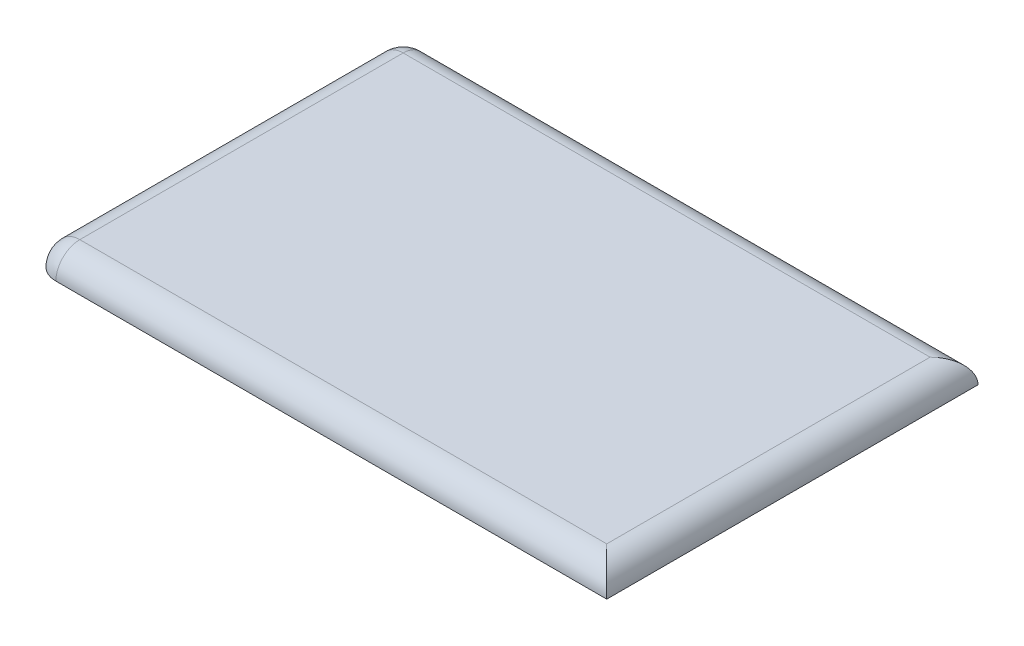
ISO-10303-21;
HEADER;
FILE_DESCRIPTION(('STEP AP214'),'2;1');
FILE_NAME('part.step','',(''),(''),'','','');
FILE_SCHEMA(('AUTOMOTIVE_DESIGN { 1 0 10303 214 1 1 1 1 }'));
ENDSEC;
DATA;
#1=APPLICATION_CONTEXT('core data for automotive mechanical design processes');
#2=APPLICATION_PROTOCOL_DEFINITION('international standard','automotive_design',2000,#1);
#3=PRODUCT_CONTEXT('',#1,'mechanical');
#4=PRODUCT('Part','Part','',(#3));
#5=PRODUCT_RELATED_PRODUCT_CATEGORY('part','',(#4));
#6=PRODUCT_DEFINITION_FORMATION('','',#4);
#7=PRODUCT_DEFINITION_CONTEXT('part definition',#1,'design');
#8=PRODUCT_DEFINITION('design','',#6,#7);
#9=PRODUCT_DEFINITION_SHAPE('','',#8);
#10=(LENGTH_UNIT() NAMED_UNIT(*) SI_UNIT(.MILLI.,.METRE.));
#11=(NAMED_UNIT(*) PLANE_ANGLE_UNIT() SI_UNIT($,.RADIAN.));
#12=(NAMED_UNIT(*) SI_UNIT($,.STERADIAN.) SOLID_ANGLE_UNIT());
#13=UNCERTAINTY_MEASURE_WITH_UNIT(LENGTH_MEASURE(1.E-05),#10,'distance_accuracy_value','');
#14=(GEOMETRIC_REPRESENTATION_CONTEXT(3) GLOBAL_UNCERTAINTY_ASSIGNED_CONTEXT((#13)) GLOBAL_UNIT_ASSIGNED_CONTEXT((#10,
#11,#12)) REPRESENTATION_CONTEXT('',''));
#15=CARTESIAN_POINT('',(0.,0.,0.));
#16=DIRECTION('',(0.,0.,1.));
#17=DIRECTION('',(1.,0.,0.));
#18=AXIS2_PLACEMENT_3D('',#15,#16,#17);
#19=CARTESIAN_POINT('',(0.,5.,0.));
#20=DIRECTION('',(0.,-1.,0.));
#21=DIRECTION('',(0.,0.,-1.));
#22=AXIS2_PLACEMENT_3D('',#19,#20,#21);
#23=PLANE('',#22);
#24=DIRECTION('',(1.,0.,0.));
#25=VECTOR('',#24,1.);
#26=CARTESIAN_POINT('',(0.,5.,-72.5));
#27=LINE('',#26,#25);
#28=CARTESIAN_POINT('',(115.,5.,-72.5));
#29=VERTEX_POINT('',#28);
#30=CARTESIAN_POINT('',(5.,5.,-72.5));
#31=VERTEX_POINT('',#30);
#32=EDGE_CURVE('E42',#29,#31,#27,.F.);
#33=ORIENTED_EDGE('',*,*,#32,.T.);
#34=DIRECTION('',(0.,0.,-1.));
#35=VECTOR('',#34,1.);
#36=CARTESIAN_POINT('',(5.,5.,0.));
#37=LINE('',#36,#35);
#38=CARTESIAN_POINT('',(5.,5.,-5.));
#39=VERTEX_POINT('',#38);
#40=EDGE_CURVE('E11',#31,#39,#37,.F.);
#41=ORIENTED_EDGE('',*,*,#40,.T.);
#42=DIRECTION('',(-1.,0.,0.));
#43=VECTOR('',#42,1.);
#44=CARTESIAN_POINT('',(120.,5.,-5.));
#45=LINE('',#44,#43);
#46=CARTESIAN_POINT('',(115.,5.,-5.));
#47=VERTEX_POINT('',#46);
#48=EDGE_CURVE('E114',#39,#47,#45,.F.);
#49=ORIENTED_EDGE('',*,*,#48,.T.);
#50=DIRECTION('',(0.,0.,1.));
#51=VECTOR('',#50,1.);
#52=CARTESIAN_POINT('',(115.,5.,-77.5));
#53=LINE('',#52,#51);
#54=EDGE_CURVE('E53',#47,#29,#53,.F.);
#55=ORIENTED_EDGE('',*,*,#54,.T.);
#56=EDGE_LOOP('',(#33,#41,#49,#55));
#57=FACE_BOUND('',#56,.T.);
#58=ADVANCED_FACE('F33',(#57),#23,.F.);
#59=CARTESIAN_POINT('',(0.,0.,0.));
#60=DIRECTION('',(0.,-1.,0.));
#61=DIRECTION('',(0.,0.,-1.));
#62=AXIS2_PLACEMENT_3D('',#59,#60,#61);
#63=PLANE('',#62);
#64=DIRECTION('',(0.,0.,-1.));
#65=VECTOR('',#64,1.);
#66=CARTESIAN_POINT('',(0.,0.,0.));
#67=LINE('',#66,#65);
#68=CARTESIAN_POINT('',(0.,0.,-5.));
#69=VERTEX_POINT('',#68);
#70=CARTESIAN_POINT('',(0.,0.,-72.5));
#71=VERTEX_POINT('',#70);
#72=EDGE_CURVE('E97',#69,#71,#67,.T.);
#73=ORIENTED_EDGE('',*,*,#72,.T.);
#74=CARTESIAN_POINT('',(5.,0.,-72.5));
#75=DIRECTION('',(0.,-1.,0.));
#76=DIRECTION('',(0.,0.,-1.));
#77=AXIS2_PLACEMENT_3D('',#74,#75,#76);
#78=CIRCLE('',#77,5.);
#79=CARTESIAN_POINT('',(5.,0.,-77.5));
#80=VERTEX_POINT('',#79);
#81=EDGE_CURVE('E116',#71,#80,#78,.T.);
#82=ORIENTED_EDGE('',*,*,#81,.T.);
#83=DIRECTION('',(1.,0.,0.));
#84=VECTOR('',#83,1.);
#85=CARTESIAN_POINT('',(0.,0.,-77.5));
#86=LINE('',#85,#84);
#87=CARTESIAN_POINT('',(120.,0.,-77.5));
#88=VERTEX_POINT('',#87);
#89=EDGE_CURVE('E86',#80,#88,#86,.T.);
#90=ORIENTED_EDGE('',*,*,#89,.T.);
#91=DIRECTION('',(0.,0.,1.));
#92=VECTOR('',#91,1.);
#93=CARTESIAN_POINT('',(120.,0.,-77.5));
#94=LINE('',#93,#92);
#95=CARTESIAN_POINT('',(120.,0.,0.));
#96=VERTEX_POINT('',#95);
#97=EDGE_CURVE('E79',#88,#96,#94,.T.);
#98=ORIENTED_EDGE('',*,*,#97,.T.);
#99=DIRECTION('',(-1.,0.,0.));
#100=VECTOR('',#99,1.);
#101=CARTESIAN_POINT('',(120.,0.,0.));
#102=LINE('',#101,#100);
#103=CARTESIAN_POINT('',(5.00000000000003,0.,0.));
#104=VERTEX_POINT('',#103);
#105=EDGE_CURVE('E82',#96,#104,#102,.T.);
#106=ORIENTED_EDGE('',*,*,#105,.T.);
#107=CARTESIAN_POINT('',(5.,0.,-5.));
#108=DIRECTION('',(0.,-1.,0.));
#109=DIRECTION('',(0.,0.,-1.));
#110=AXIS2_PLACEMENT_3D('',#107,#108,#109);
#111=CIRCLE('',#110,5.);
#112=EDGE_CURVE('E118',#104,#69,#111,.T.);
#113=ORIENTED_EDGE('',*,*,#112,.T.);
#114=EDGE_LOOP('',(#73,#82,#90,#98,#106,#113));
#115=FACE_BOUND('',#114,.T.);
#116=ADVANCED_FACE('F81',(#115),#63,.T.);
#117=CARTESIAN_POINT('',(120.,0.,-5.));
#118=DIRECTION('',(1.,0.,0.));
#119=DIRECTION('',(0.,0.,-1.));
#120=AXIS2_PLACEMENT_3D('',#117,#118,#119);
#121=CYLINDRICAL_SURFACE('',#120,5.);
#122=CARTESIAN_POINT('',(5.,0.,-5.));
#123=DIRECTION('',(-1.,0.,0.));
#124=DIRECTION('',(0.,-1.,0.));
#125=AXIS2_PLACEMENT_3D('',#122,#123,#124);
#126=CIRCLE('',#125,5.);
#127=EDGE_CURVE('E95',#104,#39,#126,.T.);
#128=ORIENTED_EDGE('',*,*,#127,.F.);
#129=ORIENTED_EDGE('',*,*,#105,.F.);
#130=CARTESIAN_POINT('',(115.,0.,-5.));
#131=DIRECTION('',(0.707106781186547,0.,-0.707106781186548));
#132=DIRECTION('',(0.707106781186548,0.,0.707106781186547));
#133=AXIS2_PLACEMENT_3D('',#130,#131,#132);
#134=ELLIPSE('',#133,7.07106781186548,5.);
#135=EDGE_CURVE('E37',#47,#96,#134,.T.);
#136=ORIENTED_EDGE('',*,*,#135,.F.);
#137=ORIENTED_EDGE('',*,*,#48,.F.);
#138=EDGE_LOOP('',(#128,#129,#136,#137));
#139=FACE_BOUND('',#138,.T.);
#140=ADVANCED_FACE('F35',(#139),#121,.T.);
#141=CARTESIAN_POINT('',(115.,0.,-77.5));
#142=DIRECTION('',(0.,0.,-1.));
#143=DIRECTION('',(-1.,0.,0.));
#144=AXIS2_PLACEMENT_3D('',#141,#142,#143);
#145=CYLINDRICAL_SURFACE('',#144,5.);
#146=ORIENTED_EDGE('',*,*,#135,.T.);
#147=ORIENTED_EDGE('',*,*,#97,.F.);
#148=CARTESIAN_POINT('',(115.,0.,-72.5));
#149=DIRECTION('',(-0.707106781186548,0.,-0.707106781186547));
#150=DIRECTION('',(0.707106781186547,0.,-0.707106781186548));
#151=AXIS2_PLACEMENT_3D('',#148,#149,#150);
#152=ELLIPSE('',#151,7.07106781186547,5.);
#153=EDGE_CURVE('E100',#29,#88,#152,.T.);
#154=ORIENTED_EDGE('',*,*,#153,.F.);
#155=ORIENTED_EDGE('',*,*,#54,.F.);
#156=EDGE_LOOP('',(#146,#147,#154,#155));
#157=FACE_BOUND('',#156,.T.);
#158=ADVANCED_FACE('F99',(#157),#145,.T.);
#159=CARTESIAN_POINT('',(5.,0.,-5.));
#160=DIRECTION('',(0.,0.,1.));
#161=DIRECTION('',(1.,0.,0.));
#162=AXIS2_PLACEMENT_3D('',#159,#160,#161);
#163=SPHERICAL_SURFACE('',#162,5.);
#164=ORIENTED_EDGE('',*,*,#112,.F.);
#165=ORIENTED_EDGE('',*,*,#127,.T.);
#166=CARTESIAN_POINT('',(5.,0.,-5.));
#167=DIRECTION('',(0.,0.,1.));
#168=DIRECTION('',(1.,0.,0.));
#169=AXIS2_PLACEMENT_3D('',#166,#167,#168);
#170=CIRCLE('',#169,5.);
#171=EDGE_CURVE('E103',#69,#39,#170,.F.);
#172=ORIENTED_EDGE('',*,*,#171,.F.);
#173=EDGE_LOOP('',(#164,#165,#172));
#174=FACE_BOUND('',#173,.T.);
#175=ADVANCED_FACE('F132',(#174),#163,.T.);
#176=CARTESIAN_POINT('',(0.,0.,-72.5));
#177=DIRECTION('',(-1.,0.,0.));
#178=DIRECTION('',(0.,0.,1.));
#179=AXIS2_PLACEMENT_3D('',#176,#177,#178);
#180=CYLINDRICAL_SURFACE('',#179,5.);
#181=ORIENTED_EDGE('',*,*,#153,.T.);
#182=ORIENTED_EDGE('',*,*,#89,.F.);
#183=CARTESIAN_POINT('',(5.,0.,-72.5));
#184=DIRECTION('',(-1.,0.,0.));
#185=DIRECTION('',(0.,0.,1.));
#186=AXIS2_PLACEMENT_3D('',#183,#184,#185);
#187=CIRCLE('',#186,5.);
#188=EDGE_CURVE('E107',#31,#80,#187,.T.);
#189=ORIENTED_EDGE('',*,*,#188,.F.);
#190=ORIENTED_EDGE('',*,*,#32,.F.);
#191=EDGE_LOOP('',(#181,#182,#189,#190));
#192=FACE_BOUND('',#191,.T.);
#193=ADVANCED_FACE('F130',(#192),#180,.T.);
#194=CARTESIAN_POINT('',(5.,0.,0.));
#195=DIRECTION('',(0.,0.,1.));
#196=DIRECTION('',(1.,0.,0.));
#197=AXIS2_PLACEMENT_3D('',#194,#195,#196);
#198=CYLINDRICAL_SURFACE('',#197,5.);
#199=ORIENTED_EDGE('',*,*,#171,.T.);
#200=ORIENTED_EDGE('',*,*,#40,.F.);
#201=CARTESIAN_POINT('',(5.,0.,-72.5));
#202=DIRECTION('',(0.,0.,-1.));
#203=DIRECTION('',(-1.,0.,0.));
#204=AXIS2_PLACEMENT_3D('',#201,#202,#203);
#205=CIRCLE('',#204,5.);
#206=EDGE_CURVE('E109',#71,#31,#205,.T.);
#207=ORIENTED_EDGE('',*,*,#206,.F.);
#208=ORIENTED_EDGE('',*,*,#72,.F.);
#209=EDGE_LOOP('',(#199,#200,#207,#208));
#210=FACE_BOUND('',#209,.T.);
#211=ADVANCED_FACE('F125',(#210),#198,.T.);
#212=CARTESIAN_POINT('',(5.,0.,-72.5));
#213=DIRECTION('',(0.,0.,1.));
#214=DIRECTION('',(1.,0.,0.));
#215=AXIS2_PLACEMENT_3D('',#212,#213,#214);
#216=SPHERICAL_SURFACE('',#215,5.);
#217=ORIENTED_EDGE('',*,*,#81,.F.);
#218=ORIENTED_EDGE('',*,*,#206,.T.);
#219=ORIENTED_EDGE('',*,*,#188,.T.);
#220=EDGE_LOOP('',(#217,#218,#219));
#221=FACE_BOUND('',#220,.T.);
#222=ADVANCED_FACE('F128',(#221),#216,.T.);
#223=CLOSED_SHELL('',(#58,#116,#140,#158,#175,#193,#211,#222));
#224=MANIFOLD_SOLID_BREP('B2',#223);
#225=ADVANCED_BREP_SHAPE_REPRESENTATION('',(#18,#224),#14);
#226=SHAPE_DEFINITION_REPRESENTATION(#9,#225);
ENDSEC;
END-ISO-10303-21;
